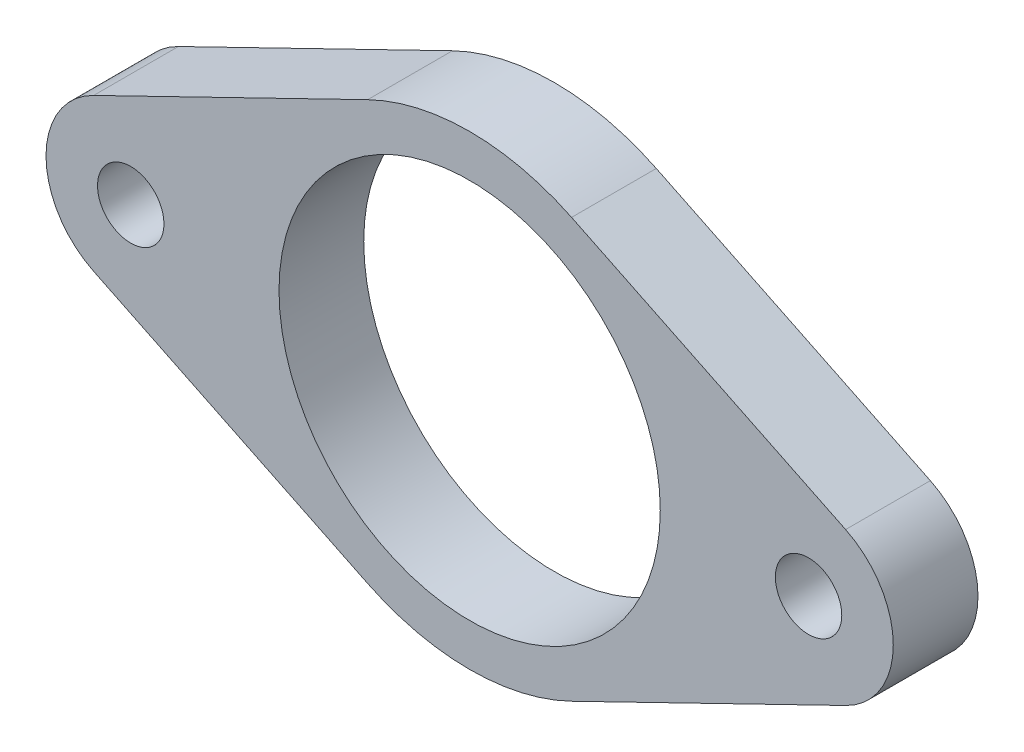
ISO-10303-21;
HEADER;
FILE_DESCRIPTION(('STEP AP214'),'2;1');
FILE_NAME('part.step','',(''),(''),'','','');
FILE_SCHEMA(('AUTOMOTIVE_DESIGN { 1 0 10303 214 1 1 1 1 }'));
ENDSEC;
DATA;
#1=APPLICATION_CONTEXT('core data for automotive mechanical design processes');
#2=APPLICATION_PROTOCOL_DEFINITION('international standard','automotive_design',2000,#1);
#3=PRODUCT_CONTEXT('',#1,'mechanical');
#4=PRODUCT('Part','Part','',(#3));
#5=PRODUCT_RELATED_PRODUCT_CATEGORY('part','',(#4));
#6=PRODUCT_DEFINITION_FORMATION('','',#4);
#7=PRODUCT_DEFINITION_CONTEXT('part definition',#1,'design');
#8=PRODUCT_DEFINITION('design','',#6,#7);
#9=PRODUCT_DEFINITION_SHAPE('','',#8);
#10=(LENGTH_UNIT() NAMED_UNIT(*) SI_UNIT(.MILLI.,.METRE.));
#11=(NAMED_UNIT(*) PLANE_ANGLE_UNIT() SI_UNIT($,.RADIAN.));
#12=(NAMED_UNIT(*) SI_UNIT($,.STERADIAN.) SOLID_ANGLE_UNIT());
#13=UNCERTAINTY_MEASURE_WITH_UNIT(LENGTH_MEASURE(1.E-05),#10,'distance_accuracy_value','');
#14=(GEOMETRIC_REPRESENTATION_CONTEXT(3) GLOBAL_UNCERTAINTY_ASSIGNED_CONTEXT((#13)) GLOBAL_UNIT_ASSIGNED_CONTEXT((#10,
#11,#12)) REPRESENTATION_CONTEXT('',''));
#15=CARTESIAN_POINT('',(0.,0.,0.));
#16=DIRECTION('',(0.,0.,1.));
#17=DIRECTION('',(1.,0.,0.));
#18=AXIS2_PLACEMENT_3D('',#15,#16,#17);
#19=CARTESIAN_POINT('',(0.,0.,6.35));
#20=DIRECTION('',(0.,0.,1.));
#21=DIRECTION('',(1.,0.,0.));
#22=AXIS2_PLACEMENT_3D('',#19,#20,#21);
#23=PLANE('',#22);
#24=CARTESIAN_POINT('',(-25.4,0.,6.35));
#25=DIRECTION('',(0.,0.,1.));
#26=DIRECTION('',(1.,0.,0.));
#27=AXIS2_PLACEMENT_3D('',#24,#25,#26);
#28=CIRCLE('',#27,2.4892);
#29=CARTESIAN_POINT('',(-22.9108,0.,6.35));
#30=VERTEX_POINT('',#29);
#31=EDGE_CURVE('E221',#30,#30,#28,.T.);
#32=ORIENTED_EDGE('',*,*,#31,.F.);
#33=EDGE_LOOP('',(#32));
#34=FACE_BOUND('',#33,.T.);
#35=CARTESIAN_POINT('',(0.,0.,6.35));
#36=DIRECTION('',(0.,0.,1.));
#37=DIRECTION('',(1.,0.,0.));
#38=AXIS2_PLACEMENT_3D('',#35,#36,#37);
#39=CIRCLE('',#38,17.4625);
#40=CARTESIAN_POINT('',(7.63984375,15.7026014954716,6.35));
#41=VERTEX_POINT('',#40);
#42=CARTESIAN_POINT('',(-7.63984375,15.7026014954716,6.35));
#43=VERTEX_POINT('',#42);
#44=EDGE_CURVE('E172',#41,#43,#39,.T.);
#45=ORIENTED_EDGE('',*,*,#44,.T.);
#46=DIRECTION('',(-0.899218410621135,-0.4375,0.));
#47=VECTOR('',#46,1.);
#48=CARTESIAN_POINT('',(-7.63984375,15.7026014954716,6.35));
#49=LINE('',#48,#47);
#50=CARTESIAN_POINT('',(-28.178125,5.7100369074442,6.35));
#51=VERTEX_POINT('',#50);
#52=EDGE_CURVE('E108',#43,#51,#49,.T.);
#53=ORIENTED_EDGE('',*,*,#52,.T.);
#54=CARTESIAN_POINT('',(-25.4,0.,6.35));
#55=DIRECTION('',(0.,0.,1.));
#56=DIRECTION('',(1.,0.,0.));
#57=AXIS2_PLACEMENT_3D('',#54,#55,#56);
#58=CIRCLE('',#57,6.35);
#59=CARTESIAN_POINT('',(-28.178125,-5.71003690744421,6.35));
#60=VERTEX_POINT('',#59);
#61=EDGE_CURVE('E193',#51,#60,#58,.T.);
#62=ORIENTED_EDGE('',*,*,#61,.T.);
#63=DIRECTION('',(0.899218410621135,-0.4375,0.));
#64=VECTOR('',#63,1.);
#65=CARTESIAN_POINT('',(-7.63984375,-15.7026014954716,6.35));
#66=LINE('',#65,#64);
#67=CARTESIAN_POINT('',(-7.63984375,-15.7026014954716,6.35));
#68=VERTEX_POINT('',#67);
#69=EDGE_CURVE('E207',#60,#68,#66,.T.);
#70=ORIENTED_EDGE('',*,*,#69,.T.);
#71=CARTESIAN_POINT('',(0.,0.,6.35));
#72=DIRECTION('',(0.,0.,1.));
#73=DIRECTION('',(-1.,0.,0.));
#74=AXIS2_PLACEMENT_3D('',#71,#72,#73);
#75=CIRCLE('',#74,17.4625);
#76=CARTESIAN_POINT('',(7.63984375,-15.7026014954716,6.35));
#77=VERTEX_POINT('',#76);
#78=EDGE_CURVE('E127',#68,#77,#75,.T.);
#79=ORIENTED_EDGE('',*,*,#78,.T.);
#80=DIRECTION('',(0.899218410621135,0.4375,0.));
#81=VECTOR('',#80,1.);
#82=CARTESIAN_POINT('',(7.63984375,-15.7026014954716,6.35));
#83=LINE('',#82,#81);
#84=CARTESIAN_POINT('',(28.178125,-5.7100369074442,6.35));
#85=VERTEX_POINT('',#84);
#86=EDGE_CURVE('E121',#77,#85,#83,.T.);
#87=ORIENTED_EDGE('',*,*,#86,.T.);
#88=CARTESIAN_POINT('',(25.4,0.,6.35));
#89=DIRECTION('',(0.,0.,1.));
#90=DIRECTION('',(-1.,0.,0.));
#91=AXIS2_PLACEMENT_3D('',#88,#89,#90);
#92=CIRCLE('',#91,6.35);
#93=CARTESIAN_POINT('',(28.178125,5.71003690744421,6.35));
#94=VERTEX_POINT('',#93);
#95=EDGE_CURVE('E125',#85,#94,#92,.T.);
#96=ORIENTED_EDGE('',*,*,#95,.T.);
#97=DIRECTION('',(-0.899218410621135,0.4375,0.));
#98=VECTOR('',#97,1.);
#99=CARTESIAN_POINT('',(7.63984375,15.7026014954716,6.35));
#100=LINE('',#99,#98);
#101=EDGE_CURVE('E65',#94,#41,#100,.T.);
#102=ORIENTED_EDGE('',*,*,#101,.T.);
#103=EDGE_LOOP('',(#45,#53,#62,#70,#79,#87,#96,#102));
#104=FACE_BOUND('',#103,.T.);
#105=CARTESIAN_POINT('',(0.,0.,6.35));
#106=DIRECTION('',(0.,0.,1.));
#107=DIRECTION('',(1.,0.,0.));
#108=AXIS2_PLACEMENT_3D('',#105,#106,#107);
#109=CIRCLE('',#108,14.2875);
#110=CARTESIAN_POINT('',(14.2875,0.,6.35));
#111=VERTEX_POINT('',#110);
#112=EDGE_CURVE('E154',#111,#111,#109,.T.);
#113=ORIENTED_EDGE('',*,*,#112,.F.);
#114=EDGE_LOOP('',(#113));
#115=FACE_BOUND('',#114,.T.);
#116=CARTESIAN_POINT('',(25.4,0.,6.35));
#117=DIRECTION('',(0.,0.,1.));
#118=DIRECTION('',(1.,0.,0.));
#119=AXIS2_PLACEMENT_3D('',#116,#117,#118);
#120=CIRCLE('',#119,2.4892);
#121=CARTESIAN_POINT('',(27.8892,0.,6.35));
#122=VERTEX_POINT('',#121);
#123=EDGE_CURVE('E229',#122,#122,#120,.T.);
#124=ORIENTED_EDGE('',*,*,#123,.F.);
#125=EDGE_LOOP('',(#124));
#126=FACE_BOUND('',#125,.T.);
#127=ADVANCED_FACE('F47',(#34,#104,#115,#126),#23,.T.);
#128=CARTESIAN_POINT('',(0.,0.,0.));
#129=DIRECTION('',(0.,0.,1.));
#130=DIRECTION('',(1.,0.,0.));
#131=AXIS2_PLACEMENT_3D('',#128,#129,#130);
#132=PLANE('',#131);
#133=CARTESIAN_POINT('',(0.,0.,0.));
#134=DIRECTION('',(0.,0.,1.));
#135=DIRECTION('',(1.,0.,0.));
#136=AXIS2_PLACEMENT_3D('',#133,#134,#135);
#137=CIRCLE('',#136,17.4625);
#138=CARTESIAN_POINT('',(7.63984375,15.7026014954716,0.));
#139=VERTEX_POINT('',#138);
#140=CARTESIAN_POINT('',(-7.63984375,15.7026014954716,0.));
#141=VERTEX_POINT('',#140);
#142=EDGE_CURVE('E149',#139,#141,#137,.T.);
#143=ORIENTED_EDGE('',*,*,#142,.F.);
#144=DIRECTION('',(-0.899218410621135,0.4375,0.));
#145=VECTOR('',#144,1.);
#146=CARTESIAN_POINT('',(7.63984375,15.7026014954716,0.));
#147=LINE('',#146,#145);
#148=CARTESIAN_POINT('',(28.178125,5.71003690744421,0.));
#149=VERTEX_POINT('',#148);
#150=EDGE_CURVE('E100',#149,#139,#147,.T.);
#151=ORIENTED_EDGE('',*,*,#150,.F.);
#152=CARTESIAN_POINT('',(25.4,0.,0.));
#153=DIRECTION('',(0.,0.,1.));
#154=DIRECTION('',(-1.,0.,0.));
#155=AXIS2_PLACEMENT_3D('',#152,#153,#154);
#156=CIRCLE('',#155,6.35);
#157=CARTESIAN_POINT('',(28.178125,-5.7100369074442,0.));
#158=VERTEX_POINT('',#157);
#159=EDGE_CURVE('E94',#158,#149,#156,.T.);
#160=ORIENTED_EDGE('',*,*,#159,.F.);
#161=DIRECTION('',(0.899218410621135,0.4375,0.));
#162=VECTOR('',#161,1.);
#163=CARTESIAN_POINT('',(7.63984375,-15.7026014954716,0.));
#164=LINE('',#163,#162);
#165=CARTESIAN_POINT('',(7.63984375,-15.7026014954716,0.));
#166=VERTEX_POINT('',#165);
#167=EDGE_CURVE('E136',#166,#158,#164,.T.);
#168=ORIENTED_EDGE('',*,*,#167,.F.);
#169=CARTESIAN_POINT('',(0.,0.,0.));
#170=DIRECTION('',(0.,0.,1.));
#171=DIRECTION('',(-1.,0.,0.));
#172=AXIS2_PLACEMENT_3D('',#169,#170,#171);
#173=CIRCLE('',#172,17.4625);
#174=CARTESIAN_POINT('',(-7.63984375,-15.7026014954716,0.));
#175=VERTEX_POINT('',#174);
#176=EDGE_CURVE('E163',#175,#166,#173,.T.);
#177=ORIENTED_EDGE('',*,*,#176,.F.);
#178=DIRECTION('',(0.899218410621135,-0.4375,0.));
#179=VECTOR('',#178,1.);
#180=CARTESIAN_POINT('',(-7.63984375,-15.7026014954716,0.));
#181=LINE('',#180,#179);
#182=CARTESIAN_POINT('',(-28.178125,-5.71003690744421,0.));
#183=VERTEX_POINT('',#182);
#184=EDGE_CURVE('E160',#183,#175,#181,.T.);
#185=ORIENTED_EDGE('',*,*,#184,.F.);
#186=CARTESIAN_POINT('',(-25.4,0.,0.));
#187=DIRECTION('',(0.,0.,1.));
#188=DIRECTION('',(1.,0.,0.));
#189=AXIS2_PLACEMENT_3D('',#186,#187,#188);
#190=CIRCLE('',#189,6.35);
#191=CARTESIAN_POINT('',(-28.178125,5.7100369074442,0.));
#192=VERTEX_POINT('',#191);
#193=EDGE_CURVE('E157',#192,#183,#190,.T.);
#194=ORIENTED_EDGE('',*,*,#193,.F.);
#195=DIRECTION('',(-0.899218410621135,-0.4375,0.));
#196=VECTOR('',#195,1.);
#197=CARTESIAN_POINT('',(-7.63984375,15.7026014954716,0.));
#198=LINE('',#197,#196);
#199=EDGE_CURVE('E153',#141,#192,#198,.T.);
#200=ORIENTED_EDGE('',*,*,#199,.F.);
#201=EDGE_LOOP('',(#143,#151,#160,#168,#177,#185,#194,#200));
#202=FACE_BOUND('',#201,.T.);
#203=CARTESIAN_POINT('',(0.,0.,0.));
#204=DIRECTION('',(0.,0.,1.));
#205=DIRECTION('',(1.,0.,0.));
#206=AXIS2_PLACEMENT_3D('',#203,#204,#205);
#207=CIRCLE('',#206,14.2875);
#208=CARTESIAN_POINT('',(14.2875,0.,0.));
#209=VERTEX_POINT('',#208);
#210=EDGE_CURVE('E217',#209,#209,#207,.T.);
#211=ORIENTED_EDGE('',*,*,#210,.T.);
#212=EDGE_LOOP('',(#211));
#213=FACE_BOUND('',#212,.T.);
#214=CARTESIAN_POINT('',(-25.4,0.,0.));
#215=DIRECTION('',(0.,0.,1.));
#216=DIRECTION('',(1.,0.,0.));
#217=AXIS2_PLACEMENT_3D('',#214,#215,#216);
#218=CIRCLE('',#217,2.4892);
#219=CARTESIAN_POINT('',(-22.9108,0.,0.));
#220=VERTEX_POINT('',#219);
#221=EDGE_CURVE('E225',#220,#220,#218,.T.);
#222=ORIENTED_EDGE('',*,*,#221,.T.);
#223=EDGE_LOOP('',(#222));
#224=FACE_BOUND('',#223,.T.);
#225=CARTESIAN_POINT('',(25.4,0.,0.));
#226=DIRECTION('',(0.,0.,1.));
#227=DIRECTION('',(1.,0.,0.));
#228=AXIS2_PLACEMENT_3D('',#225,#226,#227);
#229=CIRCLE('',#228,2.4892);
#230=CARTESIAN_POINT('',(27.8892,0.,0.));
#231=VERTEX_POINT('',#230);
#232=EDGE_CURVE('E233',#231,#231,#229,.T.);
#233=ORIENTED_EDGE('',*,*,#232,.T.);
#234=EDGE_LOOP('',(#233));
#235=FACE_BOUND('',#234,.T.);
#236=ADVANCED_FACE('F197',(#202,#213,#224,#235),#132,.F.);
#237=CARTESIAN_POINT('',(0.,0.,6.35));
#238=DIRECTION('',(0.,0.,-1.));
#239=DIRECTION('',(-1.,0.,0.));
#240=AXIS2_PLACEMENT_3D('',#237,#238,#239);
#241=CYLINDRICAL_SURFACE('',#240,17.4625);
#242=ORIENTED_EDGE('',*,*,#142,.T.);
#243=DIRECTION('',(0.,0.,-1.));
#244=VECTOR('',#243,1.);
#245=CARTESIAN_POINT('',(-7.63984375,15.7026014954716,6.35));
#246=LINE('',#245,#244);
#247=EDGE_CURVE('E11',#43,#141,#246,.T.);
#248=ORIENTED_EDGE('',*,*,#247,.F.);
#249=ORIENTED_EDGE('',*,*,#44,.F.);
#250=DIRECTION('',(0.,0.,-1.));
#251=VECTOR('',#250,1.);
#252=CARTESIAN_POINT('',(7.63984375,15.7026014954716,6.35));
#253=LINE('',#252,#251);
#254=EDGE_CURVE('E145',#41,#139,#253,.T.);
#255=ORIENTED_EDGE('',*,*,#254,.T.);
#256=EDGE_LOOP('',(#242,#248,#249,#255));
#257=FACE_BOUND('',#256,.T.);
#258=ADVANCED_FACE('F49',(#257),#241,.T.);
#259=CARTESIAN_POINT('',(-7.63984375,15.7026014954716,6.35));
#260=DIRECTION('',(0.4375,-0.899218410621135,0.));
#261=DIRECTION('',(0.899218410621135,0.4375,0.));
#262=AXIS2_PLACEMENT_3D('',#259,#260,#261);
#263=PLANE('',#262);
#264=ORIENTED_EDGE('',*,*,#199,.T.);
#265=DIRECTION('',(0.,0.,-1.));
#266=VECTOR('',#265,1.);
#267=CARTESIAN_POINT('',(-28.178125,5.7100369074442,6.35));
#268=LINE('',#267,#266);
#269=EDGE_CURVE('E57',#51,#192,#268,.T.);
#270=ORIENTED_EDGE('',*,*,#269,.F.);
#271=ORIENTED_EDGE('',*,*,#52,.F.);
#272=ORIENTED_EDGE('',*,*,#247,.T.);
#273=EDGE_LOOP('',(#264,#270,#271,#272));
#274=FACE_BOUND('',#273,.T.);
#275=ADVANCED_FACE('F268',(#274),#263,.F.);
#276=CARTESIAN_POINT('',(-25.4,0.,6.35));
#277=DIRECTION('',(0.,0.,-1.));
#278=DIRECTION('',(-1.,0.,0.));
#279=AXIS2_PLACEMENT_3D('',#276,#277,#278);
#280=CYLINDRICAL_SURFACE('',#279,6.35);
#281=ORIENTED_EDGE('',*,*,#193,.T.);
#282=DIRECTION('',(0.,0.,-1.));
#283=VECTOR('',#282,1.);
#284=CARTESIAN_POINT('',(-28.178125,-5.71003690744421,6.35));
#285=LINE('',#284,#283);
#286=EDGE_CURVE('E183',#60,#183,#285,.T.);
#287=ORIENTED_EDGE('',*,*,#286,.F.);
#288=ORIENTED_EDGE('',*,*,#61,.F.);
#289=ORIENTED_EDGE('',*,*,#269,.T.);
#290=EDGE_LOOP('',(#281,#287,#288,#289));
#291=FACE_BOUND('',#290,.T.);
#292=ADVANCED_FACE('F191',(#291),#280,.T.);
#293=CARTESIAN_POINT('',(-7.63984375,-15.7026014954716,6.35));
#294=DIRECTION('',(0.4375,0.899218410621135,0.));
#295=DIRECTION('',(-0.899218410621135,0.4375,0.));
#296=AXIS2_PLACEMENT_3D('',#293,#294,#295);
#297=PLANE('',#296);
#298=ORIENTED_EDGE('',*,*,#184,.T.);
#299=DIRECTION('',(0.,0.,-1.));
#300=VECTOR('',#299,1.);
#301=CARTESIAN_POINT('',(-7.63984375,-15.7026014954716,6.35));
#302=LINE('',#301,#300);
#303=EDGE_CURVE('E179',#68,#175,#302,.T.);
#304=ORIENTED_EDGE('',*,*,#303,.F.);
#305=ORIENTED_EDGE('',*,*,#69,.F.);
#306=ORIENTED_EDGE('',*,*,#286,.T.);
#307=EDGE_LOOP('',(#298,#304,#305,#306));
#308=FACE_BOUND('',#307,.T.);
#309=ADVANCED_FACE('F202',(#308),#297,.F.);
#310=CARTESIAN_POINT('',(0.,0.,6.35));
#311=DIRECTION('',(0.,0.,-1.));
#312=DIRECTION('',(-1.,0.,0.));
#313=AXIS2_PLACEMENT_3D('',#310,#311,#312);
#314=CYLINDRICAL_SURFACE('',#313,17.4625);
#315=ORIENTED_EDGE('',*,*,#176,.T.);
#316=DIRECTION('',(0.,0.,-1.));
#317=VECTOR('',#316,1.);
#318=CARTESIAN_POINT('',(7.63984375,-15.7026014954716,6.35));
#319=LINE('',#318,#317);
#320=EDGE_CURVE('E138',#77,#166,#319,.T.);
#321=ORIENTED_EDGE('',*,*,#320,.F.);
#322=ORIENTED_EDGE('',*,*,#78,.F.);
#323=ORIENTED_EDGE('',*,*,#303,.T.);
#324=EDGE_LOOP('',(#315,#321,#322,#323));
#325=FACE_BOUND('',#324,.T.);
#326=ADVANCED_FACE('F205',(#325),#314,.T.);
#327=CARTESIAN_POINT('',(7.63984375,-15.7026014954716,6.35));
#328=DIRECTION('',(-0.4375,0.899218410621135,0.));
#329=DIRECTION('',(-0.899218410621135,-0.4375,0.));
#330=AXIS2_PLACEMENT_3D('',#327,#328,#329);
#331=PLANE('',#330);
#332=ORIENTED_EDGE('',*,*,#167,.T.);
#333=DIRECTION('',(0.,0.,-1.));
#334=VECTOR('',#333,1.);
#335=CARTESIAN_POINT('',(28.178125,-5.7100369074442,6.35));
#336=LINE('',#335,#334);
#337=EDGE_CURVE('E133',#85,#158,#336,.T.);
#338=ORIENTED_EDGE('',*,*,#337,.F.);
#339=ORIENTED_EDGE('',*,*,#86,.F.);
#340=ORIENTED_EDGE('',*,*,#320,.T.);
#341=EDGE_LOOP('',(#332,#338,#339,#340));
#342=FACE_BOUND('',#341,.T.);
#343=ADVANCED_FACE('F134',(#342),#331,.F.);
#344=CARTESIAN_POINT('',(25.4,0.,6.35));
#345=DIRECTION('',(0.,0.,-1.));
#346=DIRECTION('',(-1.,0.,0.));
#347=AXIS2_PLACEMENT_3D('',#344,#345,#346);
#348=CYLINDRICAL_SURFACE('',#347,6.35);
#349=ORIENTED_EDGE('',*,*,#159,.T.);
#350=DIRECTION('',(0.,0.,-1.));
#351=VECTOR('',#350,1.);
#352=CARTESIAN_POINT('',(28.178125,5.71003690744421,6.35));
#353=LINE('',#352,#351);
#354=EDGE_CURVE('E139',#94,#149,#353,.T.);
#355=ORIENTED_EDGE('',*,*,#354,.F.);
#356=ORIENTED_EDGE('',*,*,#95,.F.);
#357=ORIENTED_EDGE('',*,*,#337,.T.);
#358=EDGE_LOOP('',(#349,#355,#356,#357));
#359=FACE_BOUND('',#358,.T.);
#360=ADVANCED_FACE('F141',(#359),#348,.T.);
#361=CARTESIAN_POINT('',(7.63984375,15.7026014954716,6.35));
#362=DIRECTION('',(-0.4375,-0.899218410621135,0.));
#363=DIRECTION('',(0.899218410621135,-0.4375,0.));
#364=AXIS2_PLACEMENT_3D('',#361,#362,#363);
#365=PLANE('',#364);
#366=ORIENTED_EDGE('',*,*,#150,.T.);
#367=ORIENTED_EDGE('',*,*,#254,.F.);
#368=ORIENTED_EDGE('',*,*,#101,.F.);
#369=ORIENTED_EDGE('',*,*,#354,.T.);
#370=EDGE_LOOP('',(#366,#367,#368,#369));
#371=FACE_BOUND('',#370,.T.);
#372=ADVANCED_FACE('F256',(#371),#365,.F.);
#373=CARTESIAN_POINT('',(0.,0.,6.35));
#374=DIRECTION('',(0.,0.,-1.));
#375=DIRECTION('',(-1.,0.,0.));
#376=AXIS2_PLACEMENT_3D('',#373,#374,#375);
#377=CYLINDRICAL_SURFACE('',#376,14.2875);
#378=ORIENTED_EDGE('',*,*,#112,.T.);
#379=EDGE_LOOP('',(#378));
#380=FACE_BOUND('',#379,.T.);
#381=ORIENTED_EDGE('',*,*,#210,.F.);
#382=EDGE_LOOP('',(#381));
#383=FACE_BOUND('',#382,.T.);
#384=ADVANCED_FACE('F253',(#380,#383),#377,.F.);
#385=CARTESIAN_POINT('',(-25.4,0.,6.35));
#386=DIRECTION('',(0.,0.,-1.));
#387=DIRECTION('',(-1.,0.,0.));
#388=AXIS2_PLACEMENT_3D('',#385,#386,#387);
#389=CYLINDRICAL_SURFACE('',#388,2.4892);
#390=ORIENTED_EDGE('',*,*,#31,.T.);
#391=EDGE_LOOP('',(#390));
#392=FACE_BOUND('',#391,.T.);
#393=ORIENTED_EDGE('',*,*,#221,.F.);
#394=EDGE_LOOP('',(#393));
#395=FACE_BOUND('',#394,.T.);
#396=ADVANCED_FACE('F331',(#392,#395),#389,.F.);
#397=CARTESIAN_POINT('',(25.4,0.,6.35));
#398=DIRECTION('',(0.,0.,-1.));
#399=DIRECTION('',(-1.,0.,0.));
#400=AXIS2_PLACEMENT_3D('',#397,#398,#399);
#401=CYLINDRICAL_SURFACE('',#400,2.4892);
#402=ORIENTED_EDGE('',*,*,#123,.T.);
#403=EDGE_LOOP('',(#402));
#404=FACE_BOUND('',#403,.T.);
#405=ORIENTED_EDGE('',*,*,#232,.F.);
#406=EDGE_LOOP('',(#405));
#407=FACE_BOUND('',#406,.T.);
#408=ADVANCED_FACE('F241',(#404,#407),#401,.F.);
#409=CLOSED_SHELL('',(#127,#236,#258,#275,#292,#309,#326,#343,#360,#372,#384,#396,#408));
#410=MANIFOLD_SOLID_BREP('B2',#409);
#411=ADVANCED_BREP_SHAPE_REPRESENTATION('',(#18,#410),#14);
#412=SHAPE_DEFINITION_REPRESENTATION(#9,#411);
ENDSEC;
END-ISO-10303-21;
